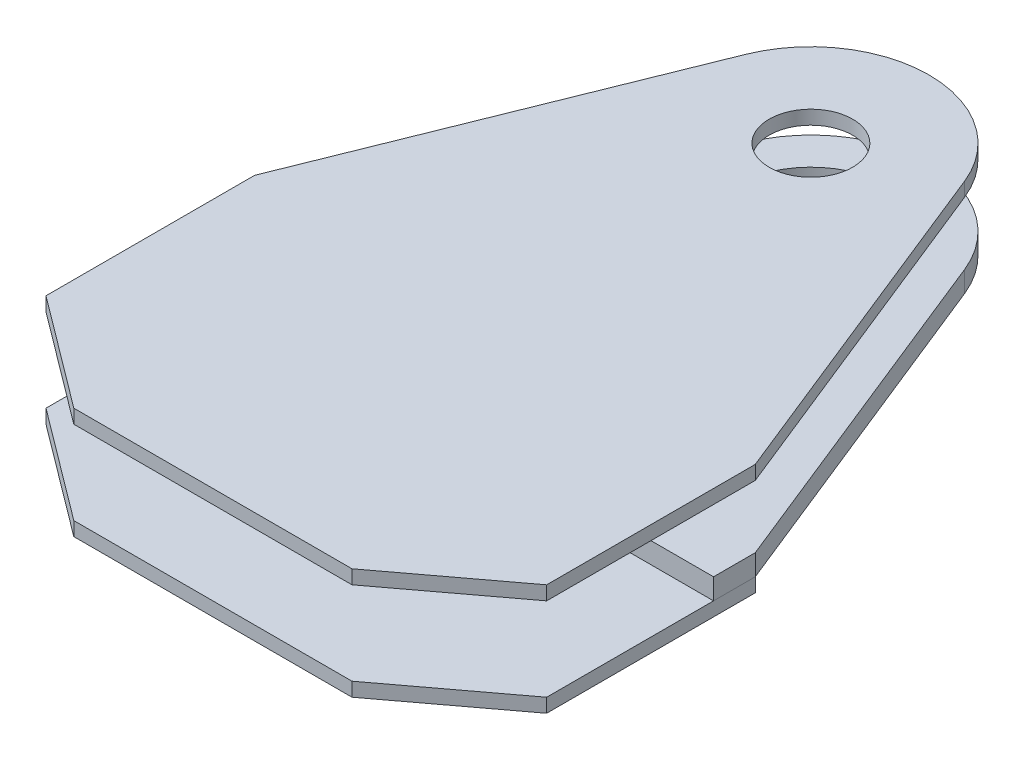
ISO-10303-21;
HEADER;
FILE_DESCRIPTION(('STEP AP214'),'2;1');
FILE_NAME('part.step','',(''),(''),'','','');
FILE_SCHEMA(('AUTOMOTIVE_DESIGN { 1 0 10303 214 1 1 1 1 }'));
ENDSEC;
DATA;
#1=APPLICATION_CONTEXT('core data for automotive mechanical design processes');
#2=APPLICATION_PROTOCOL_DEFINITION('international standard','automotive_design',2000,#1);
#3=PRODUCT_CONTEXT('',#1,'mechanical');
#4=PRODUCT('Part','Part','',(#3));
#5=PRODUCT_RELATED_PRODUCT_CATEGORY('part','',(#4));
#6=PRODUCT_DEFINITION_FORMATION('','',#4);
#7=PRODUCT_DEFINITION_CONTEXT('part definition',#1,'design');
#8=PRODUCT_DEFINITION('design','',#6,#7);
#9=PRODUCT_DEFINITION_SHAPE('','',#8);
#10=(LENGTH_UNIT() NAMED_UNIT(*) SI_UNIT(.MILLI.,.METRE.));
#11=(NAMED_UNIT(*) PLANE_ANGLE_UNIT() SI_UNIT($,.RADIAN.));
#12=(NAMED_UNIT(*) SI_UNIT($,.STERADIAN.) SOLID_ANGLE_UNIT());
#13=UNCERTAINTY_MEASURE_WITH_UNIT(LENGTH_MEASURE(1.E-05),#10,'distance_accuracy_value','');
#14=(GEOMETRIC_REPRESENTATION_CONTEXT(3) GLOBAL_UNCERTAINTY_ASSIGNED_CONTEXT((#13)) GLOBAL_UNIT_ASSIGNED_CONTEXT((#10,
#11,#12)) REPRESENTATION_CONTEXT('',''));
#15=CARTESIAN_POINT('',(0.,0.,0.));
#16=DIRECTION('',(0.,0.,1.));
#17=DIRECTION('',(1.,0.,0.));
#18=AXIS2_PLACEMENT_3D('',#15,#16,#17);
#19=CARTESIAN_POINT('',(0.,-22.225,0.));
#20=DIRECTION('',(0.,-1.,0.));
#21=DIRECTION('',(0.,0.,-1.));
#22=AXIS2_PLACEMENT_3D('',#19,#20,#21);
#23=PLANE('',#22);
#24=CARTESIAN_POINT('',(0.,-22.225,0.));
#25=DIRECTION('',(0.,-1.,0.));
#26=DIRECTION('',(0.,0.,-1.));
#27=AXIS2_PLACEMENT_3D('',#24,#25,#26);
#28=CIRCLE('',#27,39.175);
#29=CARTESIAN_POINT('',(0.,-22.225,-39.175));
#30=VERTEX_POINT('',#29);
#31=EDGE_CURVE('E11',#30,#30,#28,.T.);
#32=ORIENTED_EDGE('',*,*,#31,.T.);
#33=EDGE_LOOP('',(#32));
#34=FACE_BOUND('',#33,.T.);
#35=CARTESIAN_POINT('',(0.,-22.225,0.));
#36=DIRECTION('',(0.,-1.,0.));
#37=DIRECTION('',(0.,0.,-1.));
#38=AXIS2_PLACEMENT_3D('',#35,#36,#37);
#39=CIRCLE('',#38,32.825);
#40=CARTESIAN_POINT('',(0.,-22.225,-32.825));
#41=VERTEX_POINT('',#40);
#42=EDGE_CURVE('E55',#41,#41,#39,.T.);
#43=ORIENTED_EDGE('',*,*,#42,.F.);
#44=EDGE_LOOP('',(#43));
#45=FACE_BOUND('',#44,.T.);
#46=ADVANCED_FACE('F44',(#34,#45),#23,.T.);
#47=CARTESIAN_POINT('',(0.,-19.05,0.));
#48=DIRECTION('',(0.,-1.,0.));
#49=DIRECTION('',(0.,0.,-1.));
#50=AXIS2_PLACEMENT_3D('',#47,#48,#49);
#51=PLANE('',#50);
#52=CARTESIAN_POINT('',(0.,-19.05,0.));
#53=DIRECTION('',(0.,-1.,0.));
#54=DIRECTION('',(0.,0.,-1.));
#55=AXIS2_PLACEMENT_3D('',#52,#53,#54);
#56=CIRCLE('',#55,39.175);
#57=CARTESIAN_POINT('',(0.,-19.05,-39.175));
#58=VERTEX_POINT('',#57);
#59=EDGE_CURVE('E48',#58,#58,#56,.T.);
#60=ORIENTED_EDGE('',*,*,#59,.F.);
#61=EDGE_LOOP('',(#60));
#62=FACE_BOUND('',#61,.T.);
#63=CARTESIAN_POINT('',(0.,-19.05,0.));
#64=DIRECTION('',(0.,-1.,0.));
#65=DIRECTION('',(0.,0.,-1.));
#66=AXIS2_PLACEMENT_3D('',#63,#64,#65);
#67=CIRCLE('',#66,32.825);
#68=CARTESIAN_POINT('',(0.,-19.05,-32.825));
#69=VERTEX_POINT('',#68);
#70=EDGE_CURVE('E57',#69,#69,#67,.T.);
#71=ORIENTED_EDGE('',*,*,#70,.T.);
#72=EDGE_LOOP('',(#71));
#73=FACE_BOUND('',#72,.T.);
#74=ADVANCED_FACE('F67',(#62,#73),#51,.F.);
#75=CARTESIAN_POINT('',(0.,-22.225,0.));
#76=DIRECTION('',(0.,1.,0.));
#77=DIRECTION('',(0.,0.,1.));
#78=AXIS2_PLACEMENT_3D('',#75,#76,#77);
#79=CYLINDRICAL_SURFACE('',#78,39.175);
#80=ORIENTED_EDGE('',*,*,#31,.F.);
#81=EDGE_LOOP('',(#80));
#82=FACE_BOUND('',#81,.T.);
#83=ORIENTED_EDGE('',*,*,#59,.T.);
#84=EDGE_LOOP('',(#83));
#85=FACE_BOUND('',#84,.T.);
#86=ADVANCED_FACE('F46',(#82,#85),#79,.T.);
#87=CARTESIAN_POINT('',(0.,-22.225,0.));
#88=DIRECTION('',(0.,1.,0.));
#89=DIRECTION('',(0.,0.,1.));
#90=AXIS2_PLACEMENT_3D('',#87,#88,#89);
#91=CYLINDRICAL_SURFACE('',#90,32.825);
#92=ORIENTED_EDGE('',*,*,#42,.T.);
#93=EDGE_LOOP('',(#92));
#94=FACE_BOUND('',#93,.T.);
#95=ORIENTED_EDGE('',*,*,#70,.F.);
#96=EDGE_LOOP('',(#95));
#97=FACE_BOUND('',#96,.T.);
#98=ADVANCED_FACE('F63',(#94,#97),#91,.F.);
#99=CLOSED_SHELL('',(#46,#74,#86,#98));
#100=MANIFOLD_SOLID_BREP('B2',#99);
#101=CARTESIAN_POINT('',(-93.8103705621079,-25.4,139.7));
#102=DIRECTION('',(0.,0.,1.));
#103=DIRECTION('',(1.,0.,0.));
#104=AXIS2_PLACEMENT_3D('',#101,#102,#103);
#105=PLANE('',#104);
#106=DIRECTION('',(1.,0.,0.));
#107=VECTOR('',#106,1.);
#108=CARTESIAN_POINT('',(-93.8103705621079,-19.05,139.7));
#109=LINE('',#108,#107);
#110=CARTESIAN_POINT('',(-114.3,-19.05,139.7));
#111=VERTEX_POINT('',#110);
#112=CARTESIAN_POINT('',(-93.8103705621079,-19.05,139.7));
#113=VERTEX_POINT('',#112);
#114=EDGE_CURVE('E212',#111,#113,#109,.T.);
#115=ORIENTED_EDGE('',*,*,#114,.T.);
#116=DIRECTION('',(0.,1.,0.));
#117=VECTOR('',#116,1.);
#118=CARTESIAN_POINT('',(-93.8103705621079,-25.4,139.7));
#119=LINE('',#118,#117);
#120=CARTESIAN_POINT('',(-93.8103705621079,-25.4,139.7));
#121=VERTEX_POINT('',#120);
#122=EDGE_CURVE('E42',#121,#113,#119,.T.);
#123=ORIENTED_EDGE('',*,*,#122,.F.);
#124=DIRECTION('',(1.,0.,0.));
#125=VECTOR('',#124,1.);
#126=CARTESIAN_POINT('',(-93.8103705621079,-25.4,139.7));
#127=LINE('',#126,#125);
#128=CARTESIAN_POINT('',(-114.3,-25.4,139.7));
#129=VERTEX_POINT('',#128);
#130=EDGE_CURVE('E226',#129,#121,#127,.T.);
#131=ORIENTED_EDGE('',*,*,#130,.F.);
#132=DIRECTION('',(0.,1.,0.));
#133=VECTOR('',#132,1.);
#134=CARTESIAN_POINT('',(-114.3,-25.4,139.7));
#135=LINE('',#134,#133);
#136=EDGE_CURVE('E208',#129,#111,#135,.T.);
#137=ORIENTED_EDGE('',*,*,#136,.T.);
#138=EDGE_LOOP('',(#115,#123,#131,#137));
#139=FACE_BOUND('',#138,.T.);
#140=ADVANCED_FACE('F116',(#139),#105,.F.);
#141=CARTESIAN_POINT('',(0.,-25.4,0.));
#142=DIRECTION('',(0.,1.,0.));
#143=DIRECTION('',(0.,0.,1.));
#144=AXIS2_PLACEMENT_3D('',#141,#142,#143);
#145=CYLINDRICAL_SURFACE('',#144,168.275);
#146=CARTESIAN_POINT('',(0.,-19.05,0.));
#147=DIRECTION('',(0.,1.,0.));
#148=DIRECTION('',(0.,0.,1.));
#149=AXIS2_PLACEMENT_3D('',#146,#147,#148);
#150=CIRCLE('',#149,168.275);
#151=CARTESIAN_POINT('',(93.8103705621079,-19.05,139.7));
#152=VERTEX_POINT('',#151);
#153=EDGE_CURVE('E215',#113,#152,#150,.T.);
#154=ORIENTED_EDGE('',*,*,#153,.T.);
#155=DIRECTION('',(0.,1.,0.));
#156=VECTOR('',#155,1.);
#157=CARTESIAN_POINT('',(93.8103705621079,-25.4,139.7));
#158=LINE('',#157,#156);
#159=CARTESIAN_POINT('',(93.8103705621079,-25.4,139.7));
#160=VERTEX_POINT('',#159);
#161=EDGE_CURVE('E124',#160,#152,#158,.T.);
#162=ORIENTED_EDGE('',*,*,#161,.F.);
#163=CARTESIAN_POINT('',(0.,-25.4,0.));
#164=DIRECTION('',(0.,1.,0.));
#165=DIRECTION('',(0.,0.,1.));
#166=AXIS2_PLACEMENT_3D('',#163,#164,#165);
#167=CIRCLE('',#166,168.275);
#168=EDGE_CURVE('E175',#121,#160,#167,.T.);
#169=ORIENTED_EDGE('',*,*,#168,.F.);
#170=ORIENTED_EDGE('',*,*,#122,.T.);
#171=EDGE_LOOP('',(#154,#162,#169,#170));
#172=FACE_BOUND('',#171,.T.);
#173=ADVANCED_FACE('F261',(#172),#145,.F.);
#174=CARTESIAN_POINT('',(114.3,-25.4,139.7));
#175=DIRECTION('',(0.,0.,1.));
#176=DIRECTION('',(1.,0.,0.));
#177=AXIS2_PLACEMENT_3D('',#174,#175,#176);
#178=PLANE('',#177);
#179=DIRECTION('',(1.,0.,0.));
#180=VECTOR('',#179,1.);
#181=CARTESIAN_POINT('',(114.3,-19.05,139.7));
#182=LINE('',#181,#180);
#183=CARTESIAN_POINT('',(114.3,-19.05,139.7));
#184=VERTEX_POINT('',#183);
#185=EDGE_CURVE('E217',#152,#184,#182,.T.);
#186=ORIENTED_EDGE('',*,*,#185,.T.);
#187=DIRECTION('',(0.,1.,0.));
#188=VECTOR('',#187,1.);
#189=CARTESIAN_POINT('',(114.3,-25.4,139.7));
#190=LINE('',#189,#188);
#191=CARTESIAN_POINT('',(114.3,-25.4,139.7));
#192=VERTEX_POINT('',#191);
#193=EDGE_CURVE('E233',#192,#184,#190,.T.);
#194=ORIENTED_EDGE('',*,*,#193,.F.);
#195=DIRECTION('',(1.,0.,0.));
#196=VECTOR('',#195,1.);
#197=CARTESIAN_POINT('',(114.3,-25.4,139.7));
#198=LINE('',#197,#196);
#199=EDGE_CURVE('E241',#160,#192,#198,.T.);
#200=ORIENTED_EDGE('',*,*,#199,.F.);
#201=ORIENTED_EDGE('',*,*,#161,.T.);
#202=EDGE_LOOP('',(#186,#194,#200,#201));
#203=FACE_BOUND('',#202,.T.);
#204=ADVANCED_FACE('F239',(#203),#178,.F.);
#205=CARTESIAN_POINT('',(114.3,-25.4,234.95));
#206=DIRECTION('',(-1.,0.,0.));
#207=DIRECTION('',(0.,0.,1.));
#208=AXIS2_PLACEMENT_3D('',#205,#206,#207);
#209=PLANE('',#208);
#210=DIRECTION('',(0.,0.,1.));
#211=VECTOR('',#210,1.);
#212=CARTESIAN_POINT('',(114.3,-19.05,234.95));
#213=LINE('',#212,#211);
#214=CARTESIAN_POINT('',(114.3,-19.05,234.95));
#215=VERTEX_POINT('',#214);
#216=EDGE_CURVE('E219',#184,#215,#213,.T.);
#217=ORIENTED_EDGE('',*,*,#216,.T.);
#218=DIRECTION('',(0.,1.,0.));
#219=VECTOR('',#218,1.);
#220=CARTESIAN_POINT('',(114.3,-25.4,234.95));
#221=LINE('',#220,#219);
#222=CARTESIAN_POINT('',(114.3,-25.4,234.95));
#223=VERTEX_POINT('',#222);
#224=EDGE_CURVE('E230',#223,#215,#221,.T.);
#225=ORIENTED_EDGE('',*,*,#224,.F.);
#226=DIRECTION('',(0.,0.,1.));
#227=VECTOR('',#226,1.);
#228=CARTESIAN_POINT('',(114.3,-25.4,234.95));
#229=LINE('',#228,#227);
#230=EDGE_CURVE('E253',#192,#223,#229,.T.);
#231=ORIENTED_EDGE('',*,*,#230,.F.);
#232=ORIENTED_EDGE('',*,*,#193,.T.);
#233=EDGE_LOOP('',(#217,#225,#231,#232));
#234=FACE_BOUND('',#233,.T.);
#235=ADVANCED_FACE('F249',(#234),#209,.F.);
#236=CARTESIAN_POINT('',(63.499999999994,-25.4,273.05));
#237=DIRECTION('',(-0.599999999999955,0.,-0.800000000000034));
#238=DIRECTION('',(-0.800000000000034,0.,0.599999999999955));
#239=AXIS2_PLACEMENT_3D('',#236,#237,#238);
#240=PLANE('',#239);
#241=DIRECTION('',(-0.800000000000034,0.,0.599999999999955));
#242=VECTOR('',#241,1.);
#243=CARTESIAN_POINT('',(63.499999999994,-19.05,273.05));
#244=LINE('',#243,#242);
#245=CARTESIAN_POINT('',(63.499999999994,-19.05,273.05));
#246=VERTEX_POINT('',#245);
#247=EDGE_CURVE('E221',#215,#246,#244,.T.);
#248=ORIENTED_EDGE('',*,*,#247,.T.);
#249=DIRECTION('',(0.,1.,0.));
#250=VECTOR('',#249,1.);
#251=CARTESIAN_POINT('',(63.499999999994,-25.4,273.05));
#252=LINE('',#251,#250);
#253=CARTESIAN_POINT('',(63.499999999994,-25.4,273.05));
#254=VERTEX_POINT('',#253);
#255=EDGE_CURVE('E203',#254,#246,#252,.T.);
#256=ORIENTED_EDGE('',*,*,#255,.F.);
#257=DIRECTION('',(-0.800000000000034,0.,0.599999999999955));
#258=VECTOR('',#257,1.);
#259=CARTESIAN_POINT('',(63.499999999994,-25.4,273.05));
#260=LINE('',#259,#258);
#261=EDGE_CURVE('E194',#223,#254,#260,.T.);
#262=ORIENTED_EDGE('',*,*,#261,.F.);
#263=ORIENTED_EDGE('',*,*,#224,.T.);
#264=EDGE_LOOP('',(#248,#256,#262,#263));
#265=FACE_BOUND('',#264,.T.);
#266=ADVANCED_FACE('F252',(#265),#240,.F.);
#267=CARTESIAN_POINT('',(-63.5,-25.4,273.050000000012));
#268=DIRECTION('',(0.,0.,-1.));
#269=DIRECTION('',(-1.,0.,0.));
#270=AXIS2_PLACEMENT_3D('',#267,#268,#269);
#271=PLANE('',#270);
#272=DIRECTION('',(-1.,0.,0.));
#273=VECTOR('',#272,1.);
#274=CARTESIAN_POINT('',(-63.5,-19.05,273.050000000012));
#275=LINE('',#274,#273);
#276=CARTESIAN_POINT('',(-63.5,-19.05,273.050000000012));
#277=VERTEX_POINT('',#276);
#278=EDGE_CURVE('E202',#246,#277,#275,.T.);
#279=ORIENTED_EDGE('',*,*,#278,.T.);
#280=DIRECTION('',(0.,1.,0.));
#281=VECTOR('',#280,1.);
#282=CARTESIAN_POINT('',(-63.5,-25.4,273.050000000012));
#283=LINE('',#282,#281);
#284=CARTESIAN_POINT('',(-63.5,-25.4,273.050000000012));
#285=VERTEX_POINT('',#284);
#286=EDGE_CURVE('E199',#285,#277,#283,.T.);
#287=ORIENTED_EDGE('',*,*,#286,.F.);
#288=DIRECTION('',(-1.,0.,0.));
#289=VECTOR('',#288,1.);
#290=CARTESIAN_POINT('',(-63.5,-25.4,273.050000000012));
#291=LINE('',#290,#289);
#292=EDGE_CURVE('E188',#254,#285,#291,.T.);
#293=ORIENTED_EDGE('',*,*,#292,.F.);
#294=ORIENTED_EDGE('',*,*,#255,.T.);
#295=EDGE_LOOP('',(#279,#287,#293,#294));
#296=FACE_BOUND('',#295,.T.);
#297=ADVANCED_FACE('F200',(#296),#271,.F.);
#298=CARTESIAN_POINT('',(-114.3,-25.4,234.95));
#299=DIRECTION('',(0.600000000000121,0.,-0.79999999999991));
#300=DIRECTION('',(-0.79999999999991,0.,-0.600000000000121));
#301=AXIS2_PLACEMENT_3D('',#298,#299,#300);
#302=PLANE('',#301);
#303=DIRECTION('',(-0.79999999999991,0.,-0.600000000000121));
#304=VECTOR('',#303,1.);
#305=CARTESIAN_POINT('',(-114.3,-19.05,234.95));
#306=LINE('',#305,#304);
#307=CARTESIAN_POINT('',(-114.3,-19.05,234.95));
#308=VERTEX_POINT('',#307);
#309=EDGE_CURVE('E161',#277,#308,#306,.T.);
#310=ORIENTED_EDGE('',*,*,#309,.T.);
#311=DIRECTION('',(0.,1.,0.));
#312=VECTOR('',#311,1.);
#313=CARTESIAN_POINT('',(-114.3,-25.4,234.95));
#314=LINE('',#313,#312);
#315=CARTESIAN_POINT('',(-114.3,-25.4,234.95));
#316=VERTEX_POINT('',#315);
#317=EDGE_CURVE('E204',#316,#308,#314,.T.);
#318=ORIENTED_EDGE('',*,*,#317,.F.);
#319=DIRECTION('',(-0.79999999999991,0.,-0.600000000000121));
#320=VECTOR('',#319,1.);
#321=CARTESIAN_POINT('',(-114.3,-25.4,234.95));
#322=LINE('',#321,#320);
#323=EDGE_CURVE('E192',#285,#316,#322,.T.);
#324=ORIENTED_EDGE('',*,*,#323,.F.);
#325=ORIENTED_EDGE('',*,*,#286,.T.);
#326=EDGE_LOOP('',(#310,#318,#324,#325));
#327=FACE_BOUND('',#326,.T.);
#328=ADVANCED_FACE('F206',(#327),#302,.F.);
#329=CARTESIAN_POINT('',(-114.3,-25.4,139.7));
#330=DIRECTION('',(1.,0.,0.));
#331=DIRECTION('',(0.,0.,-1.));
#332=AXIS2_PLACEMENT_3D('',#329,#330,#331);
#333=PLANE('',#332);
#334=DIRECTION('',(0.,0.,-1.));
#335=VECTOR('',#334,1.);
#336=CARTESIAN_POINT('',(-114.3,-19.05,139.7));
#337=LINE('',#336,#335);
#338=EDGE_CURVE('E167',#308,#111,#337,.T.);
#339=ORIENTED_EDGE('',*,*,#338,.T.);
#340=ORIENTED_EDGE('',*,*,#136,.F.);
#341=DIRECTION('',(0.,0.,-1.));
#342=VECTOR('',#341,1.);
#343=CARTESIAN_POINT('',(-114.3,-25.4,139.7));
#344=LINE('',#343,#342);
#345=EDGE_CURVE('E132',#316,#129,#344,.T.);
#346=ORIENTED_EDGE('',*,*,#345,.F.);
#347=ORIENTED_EDGE('',*,*,#317,.T.);
#348=EDGE_LOOP('',(#339,#340,#346,#347));
#349=FACE_BOUND('',#348,.T.);
#350=ADVANCED_FACE('F277',(#349),#333,.F.);
#351=CARTESIAN_POINT('',(0.,-25.4,0.));
#352=DIRECTION('',(0.,1.,0.));
#353=DIRECTION('',(0.,0.,1.));
#354=AXIS2_PLACEMENT_3D('',#351,#352,#353);
#355=PLANE('',#354);
#356=ORIENTED_EDGE('',*,*,#130,.T.);
#357=ORIENTED_EDGE('',*,*,#168,.T.);
#358=ORIENTED_EDGE('',*,*,#199,.T.);
#359=ORIENTED_EDGE('',*,*,#230,.T.);
#360=ORIENTED_EDGE('',*,*,#261,.T.);
#361=ORIENTED_EDGE('',*,*,#292,.T.);
#362=ORIENTED_EDGE('',*,*,#323,.T.);
#363=ORIENTED_EDGE('',*,*,#345,.T.);
#364=EDGE_LOOP('',(#356,#357,#358,#359,#360,#361,#362,#363));
#365=FACE_BOUND('',#364,.T.);
#366=ADVANCED_FACE('F190',(#365),#355,.F.);
#367=CARTESIAN_POINT('',(0.,-19.05,0.));
#368=DIRECTION('',(0.,1.,0.));
#369=DIRECTION('',(0.,0.,1.));
#370=AXIS2_PLACEMENT_3D('',#367,#368,#369);
#371=PLANE('',#370);
#372=ORIENTED_EDGE('',*,*,#114,.F.);
#373=ORIENTED_EDGE('',*,*,#338,.F.);
#374=ORIENTED_EDGE('',*,*,#309,.F.);
#375=ORIENTED_EDGE('',*,*,#278,.F.);
#376=ORIENTED_EDGE('',*,*,#247,.F.);
#377=ORIENTED_EDGE('',*,*,#216,.F.);
#378=ORIENTED_EDGE('',*,*,#185,.F.);
#379=ORIENTED_EDGE('',*,*,#153,.F.);
#380=EDGE_LOOP('',(#372,#373,#374,#375,#376,#377,#378,#379));
#381=FACE_BOUND('',#380,.T.);
#382=ADVANCED_FACE('F245',(#381),#371,.T.);
#383=CLOSED_SHELL('',(#140,#173,#204,#235,#266,#297,#328,#350,#366,#382));
#384=MANIFOLD_SOLID_BREP('B6',#383);
#385=CARTESIAN_POINT('',(0.,25.4,0.));
#386=DIRECTION('',(0.,1.,0.));
#387=DIRECTION('',(0.,0.,1.));
#388=AXIS2_PLACEMENT_3D('',#385,#386,#387);
#389=PLANE('',#388);
#390=CARTESIAN_POINT('',(0.,25.4,0.));
#391=DIRECTION('',(0.,1.,0.));
#392=DIRECTION('',(0.,0.,1.));
#393=AXIS2_PLACEMENT_3D('',#390,#391,#392);
#394=CIRCLE('',#393,53.975);
#395=CARTESIAN_POINT('',(50.0834334662073,25.4,-20.1233773814433));
#396=VERTEX_POINT('',#395);
#397=CARTESIAN_POINT('',(-50.0834334662073,25.4,-20.1233773814433));
#398=VERTEX_POINT('',#397);
#399=EDGE_CURVE('E466',#396,#398,#394,.T.);
#400=ORIENTED_EDGE('',*,*,#399,.T.);
#401=DIRECTION('',(-0.372827742129552,0.,0.927900573713897));
#402=VECTOR('',#401,1.);
#403=CARTESIAN_POINT('',(-50.0834334662073,25.4,-20.1233773814433));
#404=LINE('',#403,#402);
#405=CARTESIAN_POINT('',(-114.3,25.4,139.7));
#406=VERTEX_POINT('',#405);
#407=EDGE_CURVE('E412',#398,#406,#404,.T.);
#408=ORIENTED_EDGE('',*,*,#407,.T.);
#409=DIRECTION('',(0.,0.,1.));
#410=VECTOR('',#409,1.);
#411=CARTESIAN_POINT('',(-114.3,25.4,139.7));
#412=LINE('',#411,#410);
#413=CARTESIAN_POINT('',(-114.3,25.4,234.95));
#414=VERTEX_POINT('',#413);
#415=EDGE_CURVE('E480',#406,#414,#412,.T.);
#416=ORIENTED_EDGE('',*,*,#415,.T.);
#417=DIRECTION('',(0.79999999999991,0.,0.600000000000121));
#418=VECTOR('',#417,1.);
#419=CARTESIAN_POINT('',(-114.3,25.4,234.95));
#420=LINE('',#419,#418);
#421=CARTESIAN_POINT('',(-63.5,25.4,273.050000000012));
#422=VERTEX_POINT('',#421);
#423=EDGE_CURVE('E495',#414,#422,#420,.T.);
#424=ORIENTED_EDGE('',*,*,#423,.T.);
#425=DIRECTION('',(1.,0.,0.));
#426=VECTOR('',#425,1.);
#427=CARTESIAN_POINT('',(-63.5,25.4,273.050000000012));
#428=LINE('',#427,#426);
#429=CARTESIAN_POINT('',(63.499999999994,25.4,273.05));
#430=VERTEX_POINT('',#429);
#431=EDGE_CURVE('E431',#422,#430,#428,.T.);
#432=ORIENTED_EDGE('',*,*,#431,.T.);
#433=DIRECTION('',(0.800000000000034,0.,-0.599999999999955));
#434=VECTOR('',#433,1.);
#435=CARTESIAN_POINT('',(63.499999999994,25.4,273.05));
#436=LINE('',#435,#434);
#437=CARTESIAN_POINT('',(114.3,25.4,234.95));
#438=VERTEX_POINT('',#437);
#439=EDGE_CURVE('E425',#430,#438,#436,.T.);
#440=ORIENTED_EDGE('',*,*,#439,.T.);
#441=DIRECTION('',(0.,0.,-1.));
#442=VECTOR('',#441,1.);
#443=CARTESIAN_POINT('',(114.3,25.4,234.95));
#444=LINE('',#443,#442);
#445=CARTESIAN_POINT('',(114.3,25.4,139.7));
#446=VERTEX_POINT('',#445);
#447=EDGE_CURVE('E429',#438,#446,#444,.T.);
#448=ORIENTED_EDGE('',*,*,#447,.T.);
#449=DIRECTION('',(-0.372827742129553,0.,-0.927900573713897));
#450=VECTOR('',#449,1.);
#451=CARTESIAN_POINT('',(114.3,25.4,139.7));
#452=LINE('',#451,#450);
#453=EDGE_CURVE('E370',#446,#396,#452,.T.);
#454=ORIENTED_EDGE('',*,*,#453,.T.);
#455=EDGE_LOOP('',(#400,#408,#416,#424,#432,#440,#448,#454));
#456=FACE_BOUND('',#455,.T.);
#457=CARTESIAN_POINT('',(0.,25.4,0.));
#458=DIRECTION('',(0.,1.,0.));
#459=DIRECTION('',(0.,0.,1.));
#460=AXIS2_PLACEMENT_3D('',#457,#458,#459);
#461=CIRCLE('',#460,19.05);
#462=CARTESIAN_POINT('',(0.,25.4,19.05));
#463=VERTEX_POINT('',#462);
#464=EDGE_CURVE('E454',#463,#463,#461,.T.);
#465=ORIENTED_EDGE('',*,*,#464,.F.);
#466=EDGE_LOOP('',(#465));
#467=FACE_BOUND('',#466,.T.);
#468=ADVANCED_FACE('F353',(#456,#467),#389,.T.);
#469=CARTESIAN_POINT('',(0.,19.05,0.));
#470=DIRECTION('',(0.,1.,0.));
#471=DIRECTION('',(0.,0.,1.));
#472=AXIS2_PLACEMENT_3D('',#469,#470,#471);
#473=PLANE('',#472);
#474=CARTESIAN_POINT('',(0.,19.05,0.));
#475=DIRECTION('',(0.,1.,0.));
#476=DIRECTION('',(0.,0.,1.));
#477=AXIS2_PLACEMENT_3D('',#474,#475,#476);
#478=CIRCLE('',#477,53.975);
#479=CARTESIAN_POINT('',(50.0834334662073,19.05,-20.1233773814433));
#480=VERTEX_POINT('',#479);
#481=CARTESIAN_POINT('',(-50.0834334662073,19.05,-20.1233773814433));
#482=VERTEX_POINT('',#481);
#483=EDGE_CURVE('E450',#480,#482,#478,.T.);
#484=ORIENTED_EDGE('',*,*,#483,.F.);
#485=DIRECTION('',(-0.372827742129553,0.,-0.927900573713897));
#486=VECTOR('',#485,1.);
#487=CARTESIAN_POINT('',(114.3,19.05,139.7));
#488=LINE('',#487,#486);
#489=CARTESIAN_POINT('',(114.3,19.05,139.7));
#490=VERTEX_POINT('',#489);
#491=EDGE_CURVE('E404',#490,#480,#488,.T.);
#492=ORIENTED_EDGE('',*,*,#491,.F.);
#493=DIRECTION('',(0.,0.,-1.));
#494=VECTOR('',#493,1.);
#495=CARTESIAN_POINT('',(114.3,19.05,158.75));
#496=LINE('',#495,#494);
#497=CARTESIAN_POINT('',(114.3,19.05,234.95));
#498=VERTEX_POINT('',#497);
#499=EDGE_CURVE('E398',#498,#490,#496,.T.);
#500=ORIENTED_EDGE('',*,*,#499,.F.);
#501=DIRECTION('',(0.800000000000034,0.,-0.599999999999955));
#502=VECTOR('',#501,1.);
#503=CARTESIAN_POINT('',(63.499999999994,19.05,273.05));
#504=LINE('',#503,#502);
#505=CARTESIAN_POINT('',(63.499999999994,19.05,273.05));
#506=VERTEX_POINT('',#505);
#507=EDGE_CURVE('E440',#506,#498,#504,.T.);
#508=ORIENTED_EDGE('',*,*,#507,.F.);
#509=DIRECTION('',(1.,0.,0.));
#510=VECTOR('',#509,1.);
#511=CARTESIAN_POINT('',(-63.5,19.05,273.050000000012));
#512=LINE('',#511,#510);
#513=CARTESIAN_POINT('',(-63.5,19.05,273.050000000012));
#514=VERTEX_POINT('',#513);
#515=EDGE_CURVE('E461',#514,#506,#512,.T.);
#516=ORIENTED_EDGE('',*,*,#515,.F.);
#517=DIRECTION('',(0.79999999999991,0.,0.600000000000121));
#518=VECTOR('',#517,1.);
#519=CARTESIAN_POINT('',(-114.3,19.05,234.95));
#520=LINE('',#519,#518);
#521=CARTESIAN_POINT('',(-114.3,19.05,234.95));
#522=VERTEX_POINT('',#521);
#523=EDGE_CURVE('E459',#522,#514,#520,.T.);
#524=ORIENTED_EDGE('',*,*,#523,.F.);
#525=DIRECTION('',(0.,0.,1.));
#526=VECTOR('',#525,1.);
#527=CARTESIAN_POINT('',(-114.3,19.05,158.75));
#528=LINE('',#527,#526);
#529=CARTESIAN_POINT('',(-114.3,19.05,139.7));
#530=VERTEX_POINT('',#529);
#531=EDGE_CURVE('E457',#530,#522,#528,.T.);
#532=ORIENTED_EDGE('',*,*,#531,.F.);
#533=DIRECTION('',(-0.372827742129552,0.,0.927900573713897));
#534=VECTOR('',#533,1.);
#535=CARTESIAN_POINT('',(-50.0834334662073,19.05,-20.1233773814433));
#536=LINE('',#535,#534);
#537=EDGE_CURVE('E453',#482,#530,#536,.T.);
#538=ORIENTED_EDGE('',*,*,#537,.F.);
#539=EDGE_LOOP('',(#484,#492,#500,#508,#516,#524,#532,#538));
#540=FACE_BOUND('',#539,.T.);
#541=CARTESIAN_POINT('',(0.,19.05,0.));
#542=DIRECTION('',(0.,1.,0.));
#543=DIRECTION('',(0.,0.,1.));
#544=AXIS2_PLACEMENT_3D('',#541,#542,#543);
#545=CIRCLE('',#544,19.05);
#546=CARTESIAN_POINT('',(0.,19.05,19.05));
#547=VERTEX_POINT('',#546);
#548=EDGE_CURVE('E501',#547,#547,#545,.T.);
#549=ORIENTED_EDGE('',*,*,#548,.T.);
#550=EDGE_LOOP('',(#549));
#551=FACE_BOUND('',#550,.T.);
#552=ADVANCED_FACE('F485',(#540,#551),#473,.F.);
#553=CARTESIAN_POINT('',(0.,25.4,0.));
#554=DIRECTION('',(0.,-1.,0.));
#555=DIRECTION('',(0.,0.,-1.));
#556=AXIS2_PLACEMENT_3D('',#553,#554,#555);
#557=CYLINDRICAL_SURFACE('',#556,53.975);
#558=ORIENTED_EDGE('',*,*,#483,.T.);
#559=DIRECTION('',(0.,-1.,0.));
#560=VECTOR('',#559,1.);
#561=CARTESIAN_POINT('',(-50.0834334662073,25.4,-20.1233773814433));
#562=LINE('',#561,#560);
#563=EDGE_CURVE('E114',#398,#482,#562,.T.);
#564=ORIENTED_EDGE('',*,*,#563,.F.);
#565=ORIENTED_EDGE('',*,*,#399,.F.);
#566=DIRECTION('',(0.,-1.,0.));
#567=VECTOR('',#566,1.);
#568=CARTESIAN_POINT('',(50.0834334662073,25.4,-20.1233773814433));
#569=LINE('',#568,#567);
#570=EDGE_CURVE('E446',#396,#480,#569,.T.);
#571=ORIENTED_EDGE('',*,*,#570,.T.);
#572=EDGE_LOOP('',(#558,#564,#565,#571));
#573=FACE_BOUND('',#572,.T.);
#574=ADVANCED_FACE('F355',(#573),#557,.T.);
#575=CARTESIAN_POINT('',(-50.0834334662073,25.4,-20.1233773814433));
#576=DIRECTION('',(0.927900573713897,0.,0.372827742129552));
#577=DIRECTION('',(0.372827742129552,0.,-0.927900573713898));
#578=AXIS2_PLACEMENT_3D('',#575,#576,#577);
#579=PLANE('',#578);
#580=ORIENTED_EDGE('',*,*,#537,.T.);
#581=DIRECTION('',(0.,-1.,0.));
#582=VECTOR('',#581,1.);
#583=CARTESIAN_POINT('',(-114.3,25.4,139.7));
#584=LINE('',#583,#582);
#585=EDGE_CURVE('E362',#406,#530,#584,.T.);
#586=ORIENTED_EDGE('',*,*,#585,.F.);
#587=ORIENTED_EDGE('',*,*,#407,.F.);
#588=ORIENTED_EDGE('',*,*,#563,.T.);
#589=EDGE_LOOP('',(#580,#586,#587,#588));
#590=FACE_BOUND('',#589,.T.);
#591=ADVANCED_FACE('F481',(#590),#579,.F.);
#592=CARTESIAN_POINT('',(-114.3,25.4,158.75));
#593=DIRECTION('',(1.,0.,0.));
#594=DIRECTION('',(0.,0.,-1.));
#595=AXIS2_PLACEMENT_3D('',#592,#593,#594);
#596=PLANE('',#595);
#597=ORIENTED_EDGE('',*,*,#531,.T.);
#598=DIRECTION('',(0.,-1.,0.));
#599=VECTOR('',#598,1.);
#600=CARTESIAN_POINT('',(-114.3,25.4,234.95));
#601=LINE('',#600,#599);
#602=EDGE_CURVE('E473',#414,#522,#601,.T.);
#603=ORIENTED_EDGE('',*,*,#602,.F.);
#604=ORIENTED_EDGE('',*,*,#415,.F.);
#605=ORIENTED_EDGE('',*,*,#585,.T.);
#606=EDGE_LOOP('',(#597,#603,#604,#605));
#607=FACE_BOUND('',#606,.T.);
#608=ADVANCED_FACE('F478',(#607),#596,.F.);
#609=CARTESIAN_POINT('',(-114.3,25.4,234.95));
#610=DIRECTION('',(0.600000000000121,0.,-0.79999999999991));
#611=DIRECTION('',(-0.79999999999991,0.,-0.600000000000121));
#612=AXIS2_PLACEMENT_3D('',#609,#610,#611);
#613=PLANE('',#612);
#614=ORIENTED_EDGE('',*,*,#523,.T.);
#615=DIRECTION('',(0.,-1.,0.));
#616=VECTOR('',#615,1.);
#617=CARTESIAN_POINT('',(-63.5,25.4,273.050000000012));
#618=LINE('',#617,#616);
#619=EDGE_CURVE('E470',#422,#514,#618,.T.);
#620=ORIENTED_EDGE('',*,*,#619,.F.);
#621=ORIENTED_EDGE('',*,*,#423,.F.);
#622=ORIENTED_EDGE('',*,*,#602,.T.);
#623=EDGE_LOOP('',(#614,#620,#621,#622));
#624=FACE_BOUND('',#623,.T.);
#625=ADVANCED_FACE('F491',(#624),#613,.F.);
#626=CARTESIAN_POINT('',(-63.5,25.4,273.050000000012));
#627=DIRECTION('',(0.,0.,-1.));
#628=DIRECTION('',(-1.,0.,0.));
#629=AXIS2_PLACEMENT_3D('',#626,#627,#628);
#630=PLANE('',#629);
#631=ORIENTED_EDGE('',*,*,#515,.T.);
#632=DIRECTION('',(0.,-1.,0.));
#633=VECTOR('',#632,1.);
#634=CARTESIAN_POINT('',(63.499999999994,25.4,273.05));
#635=LINE('',#634,#633);
#636=EDGE_CURVE('E441',#430,#506,#635,.T.);
#637=ORIENTED_EDGE('',*,*,#636,.F.);
#638=ORIENTED_EDGE('',*,*,#431,.F.);
#639=ORIENTED_EDGE('',*,*,#619,.T.);
#640=EDGE_LOOP('',(#631,#637,#638,#639));
#641=FACE_BOUND('',#640,.T.);
#642=ADVANCED_FACE('F494',(#641),#630,.F.);
#643=CARTESIAN_POINT('',(63.499999999994,25.4,273.05));
#644=DIRECTION('',(-0.599999999999955,0.,-0.800000000000034));
#645=DIRECTION('',(-0.800000000000034,0.,0.599999999999955));
#646=AXIS2_PLACEMENT_3D('',#643,#644,#645);
#647=PLANE('',#646);
#648=ORIENTED_EDGE('',*,*,#507,.T.);
#649=DIRECTION('',(0.,-1.,0.));
#650=VECTOR('',#649,1.);
#651=CARTESIAN_POINT('',(114.3,25.4,234.95));
#652=LINE('',#651,#650);
#653=EDGE_CURVE('E437',#438,#498,#652,.T.);
#654=ORIENTED_EDGE('',*,*,#653,.F.);
#655=ORIENTED_EDGE('',*,*,#439,.F.);
#656=ORIENTED_EDGE('',*,*,#636,.T.);
#657=EDGE_LOOP('',(#648,#654,#655,#656));
#658=FACE_BOUND('',#657,.T.);
#659=ADVANCED_FACE('F438',(#658),#647,.F.);
#660=CARTESIAN_POINT('',(114.3,25.4,158.75));
#661=DIRECTION('',(-1.,0.,0.));
#662=DIRECTION('',(0.,0.,1.));
#663=AXIS2_PLACEMENT_3D('',#660,#661,#662);
#664=PLANE('',#663);
#665=ORIENTED_EDGE('',*,*,#499,.T.);
#666=DIRECTION('',(0.,-1.,0.));
#667=VECTOR('',#666,1.);
#668=CARTESIAN_POINT('',(114.3,25.4,139.7));
#669=LINE('',#668,#667);
#670=EDGE_CURVE('E442',#446,#490,#669,.T.);
#671=ORIENTED_EDGE('',*,*,#670,.F.);
#672=ORIENTED_EDGE('',*,*,#447,.F.);
#673=ORIENTED_EDGE('',*,*,#653,.T.);
#674=EDGE_LOOP('',(#665,#671,#672,#673));
#675=FACE_BOUND('',#674,.T.);
#676=ADVANCED_FACE('F444',(#675),#664,.F.);
#677=CARTESIAN_POINT('',(114.3,25.4,139.7));
#678=DIRECTION('',(-0.927900573713897,0.,0.372827742129553));
#679=DIRECTION('',(0.372827742129553,0.,0.927900573713897));
#680=AXIS2_PLACEMENT_3D('',#677,#678,#679);
#681=PLANE('',#680);
#682=ORIENTED_EDGE('',*,*,#491,.T.);
#683=ORIENTED_EDGE('',*,*,#570,.F.);
#684=ORIENTED_EDGE('',*,*,#453,.F.);
#685=ORIENTED_EDGE('',*,*,#670,.T.);
#686=EDGE_LOOP('',(#682,#683,#684,#685));
#687=FACE_BOUND('',#686,.T.);
#688=ADVANCED_FACE('F517',(#687),#681,.F.);
#689=CARTESIAN_POINT('',(0.,25.4,0.));
#690=DIRECTION('',(0.,-1.,0.));
#691=DIRECTION('',(0.,0.,-1.));
#692=AXIS2_PLACEMENT_3D('',#689,#690,#691);
#693=CYLINDRICAL_SURFACE('',#692,19.05);
#694=ORIENTED_EDGE('',*,*,#464,.T.);
#695=EDGE_LOOP('',(#694));
#696=FACE_BOUND('',#695,.T.);
#697=ORIENTED_EDGE('',*,*,#548,.F.);
#698=EDGE_LOOP('',(#697));
#699=FACE_BOUND('',#698,.T.);
#700=ADVANCED_FACE('F507',(#696,#699),#693,.F.);
#701=CLOSED_SHELL('',(#468,#552,#574,#591,#608,#625,#642,#659,#676,#688,#700));
#702=MANIFOLD_SOLID_BREP('B36',#701);
#703=CARTESIAN_POINT('',(0.,-9.52499999999998,0.));
#704=DIRECTION('',(0.,-1.,0.));
#705=DIRECTION('',(0.,0.,-1.));
#706=AXIS2_PLACEMENT_3D('',#703,#704,#705);
#707=PLANE('',#706);
#708=CARTESIAN_POINT('',(0.,-9.52499999999998,0.));
#709=DIRECTION('',(0.,1.,0.));
#710=DIRECTION('',(0.,0.,-1.));
#711=AXIS2_PLACEMENT_3D('',#708,#709,#710);
#712=CIRCLE('',#711,53.975);
#713=CARTESIAN_POINT('',(50.0834334662073,-9.52499999999998,-20.1233773814433));
#714=VERTEX_POINT('',#713);
#715=CARTESIAN_POINT('',(-50.0834334662073,-9.52499999999998,-20.1233773814433));
#716=VERTEX_POINT('',#715);
#717=EDGE_CURVE('E625',#714,#716,#712,.T.);
#718=ORIENTED_EDGE('',*,*,#717,.T.);
#719=DIRECTION('',(-0.372827742129552,0.,0.927900573713897));
#720=VECTOR('',#719,1.);
#721=CARTESIAN_POINT('',(-114.3,-9.52499999999998,139.7));
#722=LINE('',#721,#720);
#723=CARTESIAN_POINT('',(-114.3,-9.52499999999998,139.7));
#724=VERTEX_POINT('',#723);
#725=EDGE_CURVE('E675',#716,#724,#722,.T.);
#726=ORIENTED_EDGE('',*,*,#725,.T.);
#727=DIRECTION('',(0.,0.,1.));
#728=VECTOR('',#727,1.);
#729=CARTESIAN_POINT('',(-114.3,-9.52499999999998,158.75));
#730=LINE('',#729,#728);
#731=CARTESIAN_POINT('',(-114.3,-9.52499999999998,158.75));
#732=VERTEX_POINT('',#731);
#733=EDGE_CURVE('E759',#724,#732,#730,.T.);
#734=ORIENTED_EDGE('',*,*,#733,.T.);
#735=DIRECTION('',(1.,0.,0.));
#736=VECTOR('',#735,1.);
#737=CARTESIAN_POINT('',(-25.4000000000001,-9.52499999999998,158.75));
#738=LINE('',#737,#736);
#739=CARTESIAN_POINT('',(-25.4000000000001,-9.52499999999998,158.75));
#740=VERTEX_POINT('',#739);
#741=EDGE_CURVE('E779',#732,#740,#738,.T.);
#742=ORIENTED_EDGE('',*,*,#741,.T.);
#743=DIRECTION('',(0.,0.,1.));
#744=VECTOR('',#743,1.);
#745=CARTESIAN_POINT('',(-25.4000000000001,-9.52499999999998,158.75));
#746=LINE('',#745,#744);
#747=CARTESIAN_POINT('',(-25.4,-9.52499999999998,183.759139638664));
#748=VERTEX_POINT('',#747);
#749=EDGE_CURVE('E776',#740,#748,#746,.T.);
#750=ORIENTED_EDGE('',*,*,#749,.T.);
#751=CARTESIAN_POINT('',(0.,-9.52499999999998,196.85));
#752=DIRECTION('',(0.,-1.,0.));
#753=DIRECTION('',(0.,0.,1.));
#754=AXIS2_PLACEMENT_3D('',#751,#752,#753);
#755=CIRCLE('',#754,28.575);
#756=CARTESIAN_POINT('',(25.4,-9.52499999999998,183.759139638664));
#757=VERTEX_POINT('',#756);
#758=EDGE_CURVE('E778',#748,#757,#755,.T.);
#759=ORIENTED_EDGE('',*,*,#758,.T.);
#760=DIRECTION('',(0.,0.,-1.));
#761=VECTOR('',#760,1.);
#762=CARTESIAN_POINT('',(25.4,-9.52499999999998,158.75));
#763=LINE('',#762,#761);
#764=CARTESIAN_POINT('',(25.4,-9.52499999999998,158.75));
#765=VERTEX_POINT('',#764);
#766=EDGE_CURVE('E701',#757,#765,#763,.T.);
#767=ORIENTED_EDGE('',*,*,#766,.T.);
#768=DIRECTION('',(1.,0.,0.));
#769=VECTOR('',#768,1.);
#770=CARTESIAN_POINT('',(114.3,-9.52499999999998,158.75));
#771=LINE('',#770,#769);
#772=CARTESIAN_POINT('',(114.3,-9.52499999999998,158.75));
#773=VERTEX_POINT('',#772);
#774=EDGE_CURVE('E695',#765,#773,#771,.T.);
#775=ORIENTED_EDGE('',*,*,#774,.T.);
#776=DIRECTION('',(0.,0.,-1.));
#777=VECTOR('',#776,1.);
#778=CARTESIAN_POINT('',(114.3,-9.52499999999998,139.7));
#779=LINE('',#778,#777);
#780=CARTESIAN_POINT('',(114.3,-9.52499999999998,139.7));
#781=VERTEX_POINT('',#780);
#782=EDGE_CURVE('E699',#773,#781,#779,.T.);
#783=ORIENTED_EDGE('',*,*,#782,.T.);
#784=DIRECTION('',(-0.372827742129553,0.,-0.927900573713897));
#785=VECTOR('',#784,1.);
#786=CARTESIAN_POINT('',(50.0834334662073,-9.52499999999998,-20.1233773814433));
#787=LINE('',#786,#785);
#788=EDGE_CURVE('E715',#781,#714,#787,.T.);
#789=ORIENTED_EDGE('',*,*,#788,.T.);
#790=EDGE_LOOP('',(#718,#726,#734,#742,#750,#759,#767,#775,#783,#789));
#791=FACE_BOUND('',#790,.T.);
#792=CARTESIAN_POINT('',(0.,-9.52499999999998,0.));
#793=DIRECTION('',(0.,1.,0.));
#794=DIRECTION('',(0.,0.,1.));
#795=AXIS2_PLACEMENT_3D('',#792,#793,#794);
#796=CIRCLE('',#795,36.);
#797=CARTESIAN_POINT('',(0.,-9.52499999999998,36.));
#798=VERTEX_POINT('',#797);
#799=EDGE_CURVE('E724',#798,#798,#796,.T.);
#800=ORIENTED_EDGE('',*,*,#799,.F.);
#801=EDGE_LOOP('',(#800));
#802=FACE_BOUND('',#801,.T.);
#803=ADVANCED_FACE('F608',(#791,#802),#707,.F.);
#804=CARTESIAN_POINT('',(0.,-19.05,0.));
#805=DIRECTION('',(0.,-1.,0.));
#806=DIRECTION('',(0.,0.,-1.));
#807=AXIS2_PLACEMENT_3D('',#804,#805,#806);
#808=PLANE('',#807);
#809=DIRECTION('',(-0.372827742129552,0.,0.927900573713897));
#810=VECTOR('',#809,1.);
#811=CARTESIAN_POINT('',(-114.3,-19.05,139.7));
#812=LINE('',#811,#810);
#813=CARTESIAN_POINT('',(-50.0834334662073,-19.05,-20.1233773814433));
#814=VERTEX_POINT('',#813);
#815=CARTESIAN_POINT('',(-114.3,-19.05,139.7));
#816=VERTEX_POINT('',#815);
#817=EDGE_CURVE('E721',#814,#816,#812,.T.);
#818=ORIENTED_EDGE('',*,*,#817,.F.);
#819=CARTESIAN_POINT('',(0.,-19.05,0.));
#820=DIRECTION('',(0.,1.,0.));
#821=DIRECTION('',(0.,0.,-1.));
#822=AXIS2_PLACEMENT_3D('',#819,#820,#821);
#823=CIRCLE('',#822,53.975);
#824=CARTESIAN_POINT('',(50.0834334662073,-19.05,-20.1233773814433));
#825=VERTEX_POINT('',#824);
#826=EDGE_CURVE('E737',#825,#814,#823,.T.);
#827=ORIENTED_EDGE('',*,*,#826,.F.);
#828=DIRECTION('',(-0.372827742129553,0.,-0.927900573713897));
#829=VECTOR('',#828,1.);
#830=CARTESIAN_POINT('',(50.0834334662073,-19.05,-20.1233773814433));
#831=LINE('',#830,#829);
#832=CARTESIAN_POINT('',(114.3,-19.05,139.7));
#833=VERTEX_POINT('',#832);
#834=EDGE_CURVE('E668',#833,#825,#831,.T.);
#835=ORIENTED_EDGE('',*,*,#834,.F.);
#836=DIRECTION('',(0.,0.,-1.));
#837=VECTOR('',#836,1.);
#838=CARTESIAN_POINT('',(114.3,-19.05,139.7));
#839=LINE('',#838,#837);
#840=CARTESIAN_POINT('',(114.3,-19.05,158.75));
#841=VERTEX_POINT('',#840);
#842=EDGE_CURVE('E661',#841,#833,#839,.T.);
#843=ORIENTED_EDGE('',*,*,#842,.F.);
#844=DIRECTION('',(1.,0.,0.));
#845=VECTOR('',#844,1.);
#846=CARTESIAN_POINT('',(114.3,-19.05,158.75));
#847=LINE('',#846,#845);
#848=CARTESIAN_POINT('',(25.4,-19.05,158.75));
#849=VERTEX_POINT('',#848);
#850=EDGE_CURVE('E709',#849,#841,#847,.T.);
#851=ORIENTED_EDGE('',*,*,#850,.F.);
#852=DIRECTION('',(0.,0.,-1.));
#853=VECTOR('',#852,1.);
#854=CARTESIAN_POINT('',(25.4,-19.05,158.75));
#855=LINE('',#854,#853);
#856=CARTESIAN_POINT('',(25.4,-19.05,183.759139638664));
#857=VERTEX_POINT('',#856);
#858=EDGE_CURVE('E732',#857,#849,#855,.T.);
#859=ORIENTED_EDGE('',*,*,#858,.F.);
#860=CARTESIAN_POINT('',(0.,-19.05,196.85));
#861=DIRECTION('',(0.,-1.,0.));
#862=DIRECTION('',(0.,0.,1.));
#863=AXIS2_PLACEMENT_3D('',#860,#861,#862);
#864=CIRCLE('',#863,28.575);
#865=CARTESIAN_POINT('',(-25.4,-19.05,183.759139638664));
#866=VERTEX_POINT('',#865);
#867=EDGE_CURVE('E730',#866,#857,#864,.T.);
#868=ORIENTED_EDGE('',*,*,#867,.F.);
#869=DIRECTION('',(0.,0.,1.));
#870=VECTOR('',#869,1.);
#871=CARTESIAN_POINT('',(-25.4000000000001,-19.05,158.75));
#872=LINE('',#871,#870);
#873=CARTESIAN_POINT('',(-25.4000000000001,-19.05,158.75));
#874=VERTEX_POINT('',#873);
#875=EDGE_CURVE('E728',#874,#866,#872,.T.);
#876=ORIENTED_EDGE('',*,*,#875,.F.);
#877=DIRECTION('',(1.,0.,0.));
#878=VECTOR('',#877,1.);
#879=CARTESIAN_POINT('',(-25.4000000000001,-19.05,158.75));
#880=LINE('',#879,#878);
#881=CARTESIAN_POINT('',(-114.3,-19.05,158.75));
#882=VERTEX_POINT('',#881);
#883=EDGE_CURVE('E726',#882,#874,#880,.T.);
#884=ORIENTED_EDGE('',*,*,#883,.F.);
#885=DIRECTION('',(0.,0.,1.));
#886=VECTOR('',#885,1.);
#887=CARTESIAN_POINT('',(-114.3,-19.05,158.75));
#888=LINE('',#887,#886);
#889=EDGE_CURVE('E723',#816,#882,#888,.T.);
#890=ORIENTED_EDGE('',*,*,#889,.F.);
#891=EDGE_LOOP('',(#818,#827,#835,#843,#851,#859,#868,#876,#884,#890));
#892=FACE_BOUND('',#891,.T.);
#893=CARTESIAN_POINT('',(0.,-19.05,0.));
#894=DIRECTION('',(0.,1.,0.));
#895=DIRECTION('',(0.,0.,1.));
#896=AXIS2_PLACEMENT_3D('',#893,#894,#895);
#897=CIRCLE('',#896,36.);
#898=CARTESIAN_POINT('',(0.,-19.05,36.));
#899=VERTEX_POINT('',#898);
#900=EDGE_CURVE('E787',#899,#899,#897,.T.);
#901=ORIENTED_EDGE('',*,*,#900,.T.);
#902=EDGE_LOOP('',(#901));
#903=FACE_BOUND('',#902,.T.);
#904=ADVANCED_FACE('F763',(#892,#903),#808,.T.);
#905=CARTESIAN_POINT('',(-114.3,-9.52499999999998,139.7));
#906=DIRECTION('',(0.927900573713898,0.,0.372827742129552));
#907=DIRECTION('',(0.372827742129552,0.,-0.927900573713897));
#908=AXIS2_PLACEMENT_3D('',#905,#906,#907);
#909=PLANE('',#908);
#910=ORIENTED_EDGE('',*,*,#817,.T.);
#911=DIRECTION('',(0.,-1.,0.));
#912=VECTOR('',#911,1.);
#913=CARTESIAN_POINT('',(-114.3,-9.52499999999998,139.7));
#914=LINE('',#913,#912);
#915=EDGE_CURVE('E617',#724,#816,#914,.T.);
#916=ORIENTED_EDGE('',*,*,#915,.F.);
#917=ORIENTED_EDGE('',*,*,#725,.F.);
#918=DIRECTION('',(0.,-1.,0.));
#919=VECTOR('',#918,1.);
#920=CARTESIAN_POINT('',(-50.0834334662073,-9.52499999999998,-20.1233773814433));
#921=LINE('',#920,#919);
#922=EDGE_CURVE('E351',#716,#814,#921,.T.);
#923=ORIENTED_EDGE('',*,*,#922,.T.);
#924=EDGE_LOOP('',(#910,#916,#917,#923));
#925=FACE_BOUND('',#924,.T.);
#926=ADVANCED_FACE('F610',(#925),#909,.F.);
#927=CARTESIAN_POINT('',(-114.3,-9.52499999999998,158.75));
#928=DIRECTION('',(1.,0.,0.));
#929=DIRECTION('',(0.,0.,-1.));
#930=AXIS2_PLACEMENT_3D('',#927,#928,#929);
#931=PLANE('',#930);
#932=ORIENTED_EDGE('',*,*,#889,.T.);
#933=DIRECTION('',(0.,-1.,0.));
#934=VECTOR('',#933,1.);
#935=CARTESIAN_POINT('',(-114.3,-9.52499999999998,158.75));
#936=LINE('',#935,#934);
#937=EDGE_CURVE('E751',#732,#882,#936,.T.);
#938=ORIENTED_EDGE('',*,*,#937,.F.);
#939=ORIENTED_EDGE('',*,*,#733,.F.);
#940=ORIENTED_EDGE('',*,*,#915,.T.);
#941=EDGE_LOOP('',(#932,#938,#939,#940));
#942=FACE_BOUND('',#941,.T.);
#943=ADVANCED_FACE('F757',(#942),#931,.F.);
#944=CARTESIAN_POINT('',(-25.4000000000001,-9.52499999999998,158.75));
#945=DIRECTION('',(0.,0.,-1.));
#946=DIRECTION('',(-1.,0.,0.));
#947=AXIS2_PLACEMENT_3D('',#944,#945,#946);
#948=PLANE('',#947);
#949=ORIENTED_EDGE('',*,*,#883,.T.);
#950=DIRECTION('',(0.,-1.,0.));
#951=VECTOR('',#950,1.);
#952=CARTESIAN_POINT('',(-25.4000000000001,-9.52499999999998,158.75));
#953=LINE('',#952,#951);
#954=EDGE_CURVE('E748',#740,#874,#953,.T.);
#955=ORIENTED_EDGE('',*,*,#954,.F.);
#956=ORIENTED_EDGE('',*,*,#741,.F.);
#957=ORIENTED_EDGE('',*,*,#937,.T.);
#958=EDGE_LOOP('',(#949,#955,#956,#957));
#959=FACE_BOUND('',#958,.T.);
#960=ADVANCED_FACE('F770',(#959),#948,.F.);
#961=CARTESIAN_POINT('',(-25.4000000000001,-9.52499999999998,158.75));
#962=DIRECTION('',(1.,0.,0.));
#963=DIRECTION('',(0.,0.,-1.));
#964=AXIS2_PLACEMENT_3D('',#961,#962,#963);
#965=PLANE('',#964);
#966=ORIENTED_EDGE('',*,*,#875,.T.);
#967=DIRECTION('',(0.,-1.,0.));
#968=VECTOR('',#967,1.);
#969=CARTESIAN_POINT('',(-25.4,-9.52499999999998,183.759139638664));
#970=LINE('',#969,#968);
#971=EDGE_CURVE('E745',#748,#866,#970,.T.);
#972=ORIENTED_EDGE('',*,*,#971,.F.);
#973=ORIENTED_EDGE('',*,*,#749,.F.);
#974=ORIENTED_EDGE('',*,*,#954,.T.);
#975=EDGE_LOOP('',(#966,#972,#973,#974));
#976=FACE_BOUND('',#975,.T.);
#977=ADVANCED_FACE('F774',(#976),#965,.F.);
#978=CARTESIAN_POINT('',(0.,-9.52499999999998,196.85));
#979=DIRECTION('',(0.,-1.,0.));
#980=DIRECTION('',(0.,0.,-1.));
#981=AXIS2_PLACEMENT_3D('',#978,#979,#980);
#982=CYLINDRICAL_SURFACE('',#981,28.575);
#983=ORIENTED_EDGE('',*,*,#867,.T.);
#984=DIRECTION('',(0.,-1.,0.));
#985=VECTOR('',#984,1.);
#986=CARTESIAN_POINT('',(25.4,-9.52499999999998,183.759139638664));
#987=LINE('',#986,#985);
#988=EDGE_CURVE('E742',#757,#857,#987,.T.);
#989=ORIENTED_EDGE('',*,*,#988,.F.);
#990=ORIENTED_EDGE('',*,*,#758,.F.);
#991=ORIENTED_EDGE('',*,*,#971,.T.);
#992=EDGE_LOOP('',(#983,#989,#990,#991));
#993=FACE_BOUND('',#992,.T.);
#994=ADVANCED_FACE('F816',(#993),#982,.F.);
#995=CARTESIAN_POINT('',(25.4,-9.52499999999998,158.75));
#996=DIRECTION('',(-1.,0.,0.));
#997=DIRECTION('',(0.,0.,1.));
#998=AXIS2_PLACEMENT_3D('',#995,#996,#997);
#999=PLANE('',#998);
#1000=ORIENTED_EDGE('',*,*,#858,.T.);
#1001=DIRECTION('',(0.,-1.,0.));
#1002=VECTOR('',#1001,1.);
#1003=CARTESIAN_POINT('',(25.4,-9.52499999999998,158.75));
#1004=LINE('',#1003,#1002);
#1005=EDGE_CURVE('E710',#765,#849,#1004,.T.);
#1006=ORIENTED_EDGE('',*,*,#1005,.F.);
#1007=ORIENTED_EDGE('',*,*,#766,.F.);
#1008=ORIENTED_EDGE('',*,*,#988,.T.);
#1009=EDGE_LOOP('',(#1000,#1006,#1007,#1008));
#1010=FACE_BOUND('',#1009,.T.);
#1011=ADVANCED_FACE('F813',(#1010),#999,.F.);
#1012=CARTESIAN_POINT('',(114.3,-9.52499999999998,158.75));
#1013=DIRECTION('',(0.,0.,-1.));
#1014=DIRECTION('',(-1.,0.,0.));
#1015=AXIS2_PLACEMENT_3D('',#1012,#1013,#1014);
#1016=PLANE('',#1015);
#1017=ORIENTED_EDGE('',*,*,#850,.T.);
#1018=DIRECTION('',(0.,-1.,0.));
#1019=VECTOR('',#1018,1.);
#1020=CARTESIAN_POINT('',(114.3,-9.52499999999998,158.75));
#1021=LINE('',#1020,#1019);
#1022=EDGE_CURVE('E706',#773,#841,#1021,.T.);
#1023=ORIENTED_EDGE('',*,*,#1022,.F.);
#1024=ORIENTED_EDGE('',*,*,#774,.F.);
#1025=ORIENTED_EDGE('',*,*,#1005,.T.);
#1026=EDGE_LOOP('',(#1017,#1023,#1024,#1025));
#1027=FACE_BOUND('',#1026,.T.);
#1028=ADVANCED_FACE('F707',(#1027),#1016,.F.);
#1029=CARTESIAN_POINT('',(114.3,-9.52499999999998,139.7));
#1030=DIRECTION('',(-1.,0.,0.));
#1031=DIRECTION('',(0.,0.,1.));
#1032=AXIS2_PLACEMENT_3D('',#1029,#1030,#1031);
#1033=PLANE('',#1032);
#1034=ORIENTED_EDGE('',*,*,#842,.T.);
#1035=DIRECTION('',(0.,-1.,0.));
#1036=VECTOR('',#1035,1.);
#1037=CARTESIAN_POINT('',(114.3,-9.52499999999998,139.7));
#1038=LINE('',#1037,#1036);
#1039=EDGE_CURVE('E711',#781,#833,#1038,.T.);
#1040=ORIENTED_EDGE('',*,*,#1039,.F.);
#1041=ORIENTED_EDGE('',*,*,#782,.F.);
#1042=ORIENTED_EDGE('',*,*,#1022,.T.);
#1043=EDGE_LOOP('',(#1034,#1040,#1041,#1042));
#1044=FACE_BOUND('',#1043,.T.);
#1045=ADVANCED_FACE('F713',(#1044),#1033,.F.);
#1046=CARTESIAN_POINT('',(50.0834334662073,-9.52499999999998,-20.1233773814433));
#1047=DIRECTION('',(-0.927900573713897,0.,0.372827742129553));
#1048=DIRECTION('',(0.372827742129553,0.,0.927900573713897));
#1049=AXIS2_PLACEMENT_3D('',#1046,#1047,#1048);
#1050=PLANE('',#1049);
#1051=ORIENTED_EDGE('',*,*,#834,.T.);
#1052=DIRECTION('',(0.,-1.,0.));
#1053=VECTOR('',#1052,1.);
#1054=CARTESIAN_POINT('',(50.0834334662073,-9.52499999999998,-20.1233773814433));
#1055=LINE('',#1054,#1053);
#1056=EDGE_CURVE('E717',#714,#825,#1055,.T.);
#1057=ORIENTED_EDGE('',*,*,#1056,.F.);
#1058=ORIENTED_EDGE('',*,*,#788,.F.);
#1059=ORIENTED_EDGE('',*,*,#1039,.T.);
#1060=EDGE_LOOP('',(#1051,#1057,#1058,#1059));
#1061=FACE_BOUND('',#1060,.T.);
#1062=ADVANCED_FACE('F806',(#1061),#1050,.F.);
#1063=CARTESIAN_POINT('',(0.,-9.52499999999998,0.));
#1064=DIRECTION('',(0.,-1.,0.));
#1065=DIRECTION('',(0.,0.,-1.));
#1066=AXIS2_PLACEMENT_3D('',#1063,#1064,#1065);
#1067=CYLINDRICAL_SURFACE('',#1066,53.975);
#1068=ORIENTED_EDGE('',*,*,#826,.T.);
#1069=ORIENTED_EDGE('',*,*,#922,.F.);
#1070=ORIENTED_EDGE('',*,*,#717,.F.);
#1071=ORIENTED_EDGE('',*,*,#1056,.T.);
#1072=EDGE_LOOP('',(#1068,#1069,#1070,#1071));
#1073=FACE_BOUND('',#1072,.T.);
#1074=ADVANCED_FACE('F803',(#1073),#1067,.T.);
#1075=CARTESIAN_POINT('',(0.,-9.52499999999998,0.));
#1076=DIRECTION('',(0.,-1.,0.));
#1077=DIRECTION('',(0.,0.,-1.));
#1078=AXIS2_PLACEMENT_3D('',#1075,#1076,#1077);
#1079=CYLINDRICAL_SURFACE('',#1078,36.);
#1080=ORIENTED_EDGE('',*,*,#799,.T.);
#1081=EDGE_LOOP('',(#1080));
#1082=FACE_BOUND('',#1081,.T.);
#1083=ORIENTED_EDGE('',*,*,#900,.F.);
#1084=EDGE_LOOP('',(#1083));
#1085=FACE_BOUND('',#1084,.T.);
#1086=ADVANCED_FACE('F793',(#1082,#1085),#1079,.F.);
#1087=CLOSED_SHELL('',(#803,#904,#926,#943,#960,#977,#994,#1011,#1028,#1045,#1062,#1074,#1086));
#1088=MANIFOLD_SOLID_BREP('B108',#1087);
#1089=ADVANCED_BREP_SHAPE_REPRESENTATION('',(#18,#100,#384,#702,#1088),#14);
#1090=SHAPE_DEFINITION_REPRESENTATION(#9,#1089);
ENDSEC;
END-ISO-10303-21;
